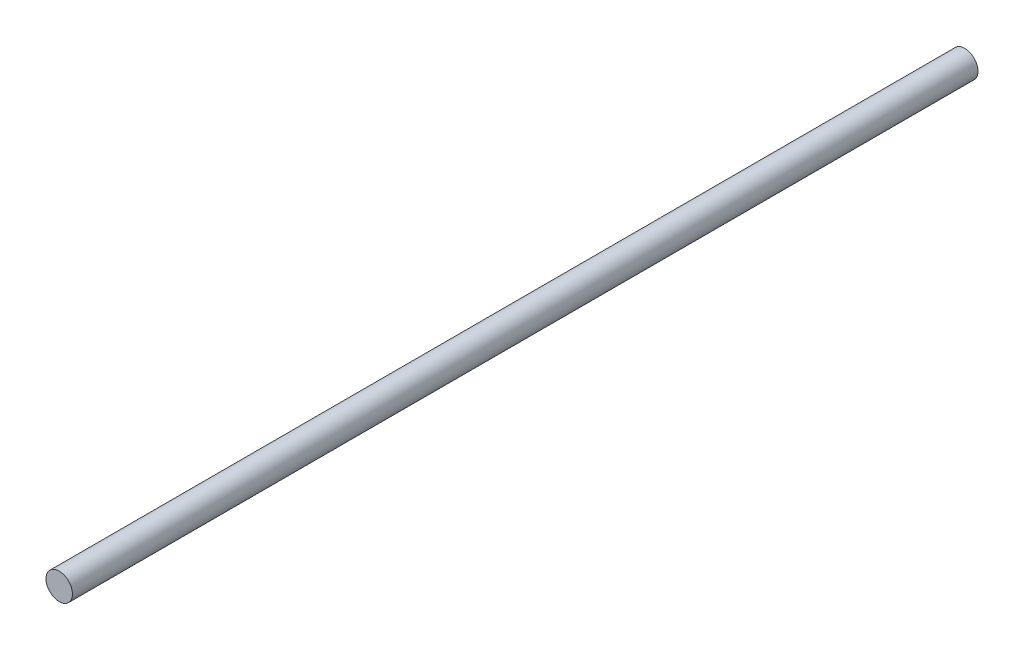
ISO-10303-21;
HEADER;
FILE_DESCRIPTION(('STEP AP214'),'2;1');
FILE_NAME('part.step','',(''),(''),'','','');
FILE_SCHEMA(('AUTOMOTIVE_DESIGN { 1 0 10303 214 1 1 1 1 }'));
ENDSEC;
DATA;
#1=APPLICATION_CONTEXT('core data for automotive mechanical design processes');
#2=APPLICATION_PROTOCOL_DEFINITION('international standard','automotive_design',2000,#1);
#3=PRODUCT_CONTEXT('',#1,'mechanical');
#4=PRODUCT('Part','Part','',(#3));
#5=PRODUCT_RELATED_PRODUCT_CATEGORY('part','',(#4));
#6=PRODUCT_DEFINITION_FORMATION('','',#4);
#7=PRODUCT_DEFINITION_CONTEXT('part definition',#1,'design');
#8=PRODUCT_DEFINITION('design','',#6,#7);
#9=PRODUCT_DEFINITION_SHAPE('','',#8);
#10=(LENGTH_UNIT() NAMED_UNIT(*) SI_UNIT(.MILLI.,.METRE.));
#11=(NAMED_UNIT(*) PLANE_ANGLE_UNIT() SI_UNIT($,.RADIAN.));
#12=(NAMED_UNIT(*) SI_UNIT($,.STERADIAN.) SOLID_ANGLE_UNIT());
#13=UNCERTAINTY_MEASURE_WITH_UNIT(LENGTH_MEASURE(1.E-05),#10,'distance_accuracy_value','');
#14=(GEOMETRIC_REPRESENTATION_CONTEXT(3) GLOBAL_UNCERTAINTY_ASSIGNED_CONTEXT((#13)) GLOBAL_UNIT_ASSIGNED_CONTEXT((#10,
#11,#12)) REPRESENTATION_CONTEXT('',''));
#15=CARTESIAN_POINT('',(0.,0.,0.));
#16=DIRECTION('',(0.,0.,1.));
#17=DIRECTION('',(1.,0.,0.));
#18=AXIS2_PLACEMENT_3D('',#15,#16,#17);
#19=CARTESIAN_POINT('',(0.,0.,-171.));
#20=DIRECTION('',(0.,0.,1.));
#21=DIRECTION('',(1.,0.,0.));
#22=AXIS2_PLACEMENT_3D('',#19,#20,#21);
#23=CYLINDRICAL_SURFACE('',#22,2.5);
#24=CARTESIAN_POINT('',(0.,0.,-171.));
#25=DIRECTION('',(0.,0.,1.));
#26=DIRECTION('',(1.,0.,0.));
#27=AXIS2_PLACEMENT_3D('',#24,#25,#26);
#28=CIRCLE('',#27,2.5);
#29=CARTESIAN_POINT('',(2.5,0.,-171.));
#30=VERTEX_POINT('',#29);
#31=EDGE_CURVE('E10',#30,#30,#28,.T.);
#32=ORIENTED_EDGE('',*,*,#31,.T.);
#33=EDGE_LOOP('',(#32));
#34=FACE_BOUND('',#33,.T.);
#35=CARTESIAN_POINT('',(0.,0.,0.));
#36=DIRECTION('',(0.,0.,1.));
#37=DIRECTION('',(1.,0.,0.));
#38=AXIS2_PLACEMENT_3D('',#35,#36,#37);
#39=CIRCLE('',#38,2.5);
#40=CARTESIAN_POINT('',(2.5,0.,0.));
#41=VERTEX_POINT('',#40);
#42=EDGE_CURVE('E33',#41,#41,#39,.T.);
#43=ORIENTED_EDGE('',*,*,#42,.F.);
#44=EDGE_LOOP('',(#43));
#45=FACE_BOUND('',#44,.T.);
#46=ADVANCED_FACE('F30',(#34,#45),#23,.T.);
#47=CARTESIAN_POINT('',(0.,0.,-171.));
#48=DIRECTION('',(0.,0.,1.));
#49=DIRECTION('',(1.,0.,0.));
#50=AXIS2_PLACEMENT_3D('',#47,#48,#49);
#51=PLANE('',#50);
#52=ORIENTED_EDGE('',*,*,#31,.F.);
#53=EDGE_LOOP('',(#52));
#54=FACE_BOUND('',#53,.T.);
#55=ADVANCED_FACE('F45',(#54),#51,.F.);
#56=CARTESIAN_POINT('',(0.,0.,0.));
#57=DIRECTION('',(0.,0.,1.));
#58=DIRECTION('',(1.,0.,0.));
#59=AXIS2_PLACEMENT_3D('',#56,#57,#58);
#60=PLANE('',#59);
#61=ORIENTED_EDGE('',*,*,#42,.T.);
#62=EDGE_LOOP('',(#61));
#63=FACE_BOUND('',#62,.T.);
#64=ADVANCED_FACE('F42',(#63),#60,.T.);
#65=CLOSED_SHELL('',(#46,#55,#64));
#66=MANIFOLD_SOLID_BREP('B2',#65);
#67=ADVANCED_BREP_SHAPE_REPRESENTATION('',(#18,#66),#14);
#68=SHAPE_DEFINITION_REPRESENTATION(#9,#67);
ENDSEC;
END-ISO-10303-21;
